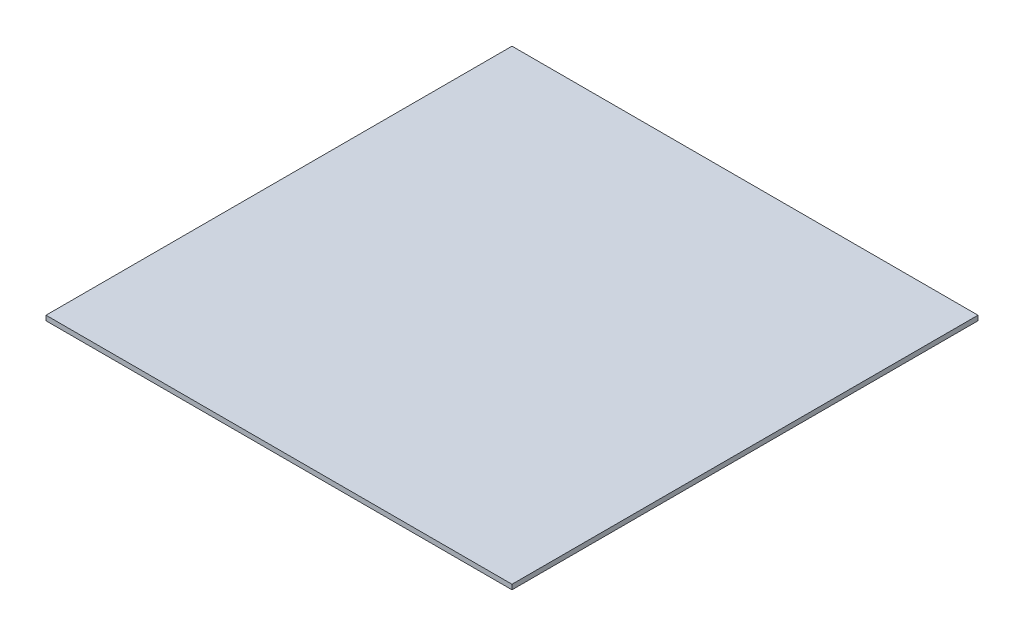
ISO-10303-21;
HEADER;
FILE_DESCRIPTION(('STEP AP214'),'2;1');
FILE_NAME('part.step','',(''),(''),'','','');
FILE_SCHEMA(('AUTOMOTIVE_DESIGN { 1 0 10303 214 1 1 1 1 }'));
ENDSEC;
DATA;
#1=APPLICATION_CONTEXT('core data for automotive mechanical design processes');
#2=APPLICATION_PROTOCOL_DEFINITION('international standard','automotive_design',2000,#1);
#3=PRODUCT_CONTEXT('',#1,'mechanical');
#4=PRODUCT('Part','Part','',(#3));
#5=PRODUCT_RELATED_PRODUCT_CATEGORY('part','',(#4));
#6=PRODUCT_DEFINITION_FORMATION('','',#4);
#7=PRODUCT_DEFINITION_CONTEXT('part definition',#1,'design');
#8=PRODUCT_DEFINITION('design','',#6,#7);
#9=PRODUCT_DEFINITION_SHAPE('','',#8);
#10=(LENGTH_UNIT() NAMED_UNIT(*) SI_UNIT(.MILLI.,.METRE.));
#11=(NAMED_UNIT(*) PLANE_ANGLE_UNIT() SI_UNIT($,.RADIAN.));
#12=(NAMED_UNIT(*) SI_UNIT($,.STERADIAN.) SOLID_ANGLE_UNIT());
#13=UNCERTAINTY_MEASURE_WITH_UNIT(LENGTH_MEASURE(1.E-05),#10,'distance_accuracy_value','');
#14=(GEOMETRIC_REPRESENTATION_CONTEXT(3) GLOBAL_UNCERTAINTY_ASSIGNED_CONTEXT((#13)) GLOBAL_UNIT_ASSIGNED_CONTEXT((#10,
#11,#12)) REPRESENTATION_CONTEXT('',''));
#15=CARTESIAN_POINT('',(0.,0.,0.));
#16=DIRECTION('',(0.,0.,1.));
#17=DIRECTION('',(1.,0.,0.));
#18=AXIS2_PLACEMENT_3D('',#15,#16,#17);
#19=CARTESIAN_POINT('',(0.,12.7,0.));
#20=DIRECTION('',(0.,0.,-1.));
#21=DIRECTION('',(-1.,0.,0.));
#22=AXIS2_PLACEMENT_3D('',#19,#20,#21);
#23=PLANE('',#22);
#24=DIRECTION('',(1.,0.,0.));
#25=VECTOR('',#24,1.);
#26=CARTESIAN_POINT('',(0.,0.,0.));
#27=LINE('',#26,#25);
#28=CARTESIAN_POINT('',(0.,0.,0.));
#29=VERTEX_POINT('',#28);
#30=CARTESIAN_POINT('',(1219.2,0.,0.));
#31=VERTEX_POINT('',#30);
#32=EDGE_CURVE('E100',#29,#31,#27,.T.);
#33=ORIENTED_EDGE('',*,*,#32,.F.);
#34=DIRECTION('',(0.,-1.,0.));
#35=VECTOR('',#34,1.);
#36=CARTESIAN_POINT('',(0.,12.7,0.));
#37=LINE('',#36,#35);
#38=CARTESIAN_POINT('',(0.,12.7,0.));
#39=VERTEX_POINT('',#38);
#40=EDGE_CURVE('E11',#39,#29,#37,.T.);
#41=ORIENTED_EDGE('',*,*,#40,.F.);
#42=DIRECTION('',(1.,0.,0.));
#43=VECTOR('',#42,1.);
#44=CARTESIAN_POINT('',(0.,12.7,0.));
#45=LINE('',#44,#43);
#46=CARTESIAN_POINT('',(1219.2,12.7,0.));
#47=VERTEX_POINT('',#46);
#48=EDGE_CURVE('E95',#39,#47,#45,.T.);
#49=ORIENTED_EDGE('',*,*,#48,.T.);
#50=DIRECTION('',(0.,-1.,0.));
#51=VECTOR('',#50,1.);
#52=CARTESIAN_POINT('',(1219.2,12.7,0.));
#53=LINE('',#52,#51);
#54=EDGE_CURVE('E38',#47,#31,#53,.T.);
#55=ORIENTED_EDGE('',*,*,#54,.T.);
#56=EDGE_LOOP('',(#33,#41,#49,#55));
#57=FACE_BOUND('',#56,.T.);
#58=ADVANCED_FACE('F35',(#57),#23,.T.);
#59=CARTESIAN_POINT('',(0.,12.7,0.));
#60=DIRECTION('',(1.,0.,0.));
#61=DIRECTION('',(0.,0.,-1.));
#62=AXIS2_PLACEMENT_3D('',#59,#60,#61);
#63=PLANE('',#62);
#64=DIRECTION('',(0.,0.,1.));
#65=VECTOR('',#64,1.);
#66=CARTESIAN_POINT('',(0.,0.,0.));
#67=LINE('',#66,#65);
#68=CARTESIAN_POINT('',(1.49308937752045E-13,0.,1219.2));
#69=VERTEX_POINT('',#68);
#70=EDGE_CURVE('E68',#29,#69,#67,.T.);
#71=ORIENTED_EDGE('',*,*,#70,.T.);
#72=DIRECTION('',(0.,-1.,0.));
#73=VECTOR('',#72,1.);
#74=CARTESIAN_POINT('',(1.49308937752045E-13,12.7,1219.2));
#75=LINE('',#74,#73);
#76=CARTESIAN_POINT('',(1.49308937752045E-13,12.7,1219.2));
#77=VERTEX_POINT('',#76);
#78=EDGE_CURVE('E44',#77,#69,#75,.T.);
#79=ORIENTED_EDGE('',*,*,#78,.F.);
#80=DIRECTION('',(0.,0.,1.));
#81=VECTOR('',#80,1.);
#82=CARTESIAN_POINT('',(0.,12.7,0.));
#83=LINE('',#82,#81);
#84=EDGE_CURVE('E85',#39,#77,#83,.T.);
#85=ORIENTED_EDGE('',*,*,#84,.F.);
#86=ORIENTED_EDGE('',*,*,#40,.T.);
#87=EDGE_LOOP('',(#71,#79,#85,#86));
#88=FACE_BOUND('',#87,.T.);
#89=ADVANCED_FACE('F110',(#88),#63,.F.);
#90=CARTESIAN_POINT('',(1.49308937752045E-13,12.7,1219.2));
#91=DIRECTION('',(0.,0.,-1.));
#92=DIRECTION('',(-1.,0.,0.));
#93=AXIS2_PLACEMENT_3D('',#90,#91,#92);
#94=PLANE('',#93);
#95=DIRECTION('',(1.,0.,0.));
#96=VECTOR('',#95,1.);
#97=CARTESIAN_POINT('',(1.49308937752045E-13,0.,1219.2));
#98=LINE('',#97,#96);
#99=CARTESIAN_POINT('',(1219.2,0.,1219.2));
#100=VERTEX_POINT('',#99);
#101=EDGE_CURVE('E92',#69,#100,#98,.T.);
#102=ORIENTED_EDGE('',*,*,#101,.T.);
#103=DIRECTION('',(0.,-1.,0.));
#104=VECTOR('',#103,1.);
#105=CARTESIAN_POINT('',(1219.2,12.7,1219.2));
#106=LINE('',#105,#104);
#107=CARTESIAN_POINT('',(1219.2,12.7,1219.2));
#108=VERTEX_POINT('',#107);
#109=EDGE_CURVE('E89',#108,#100,#106,.T.);
#110=ORIENTED_EDGE('',*,*,#109,.F.);
#111=DIRECTION('',(1.,0.,0.));
#112=VECTOR('',#111,1.);
#113=CARTESIAN_POINT('',(1.49308937752045E-13,12.7,1219.2));
#114=LINE('',#113,#112);
#115=EDGE_CURVE('E80',#77,#108,#114,.T.);
#116=ORIENTED_EDGE('',*,*,#115,.F.);
#117=ORIENTED_EDGE('',*,*,#78,.T.);
#118=EDGE_LOOP('',(#102,#110,#116,#117));
#119=FACE_BOUND('',#118,.T.);
#120=ADVANCED_FACE('F90',(#119),#94,.F.);
#121=CARTESIAN_POINT('',(1219.2,12.7,0.));
#122=DIRECTION('',(1.,0.,0.));
#123=DIRECTION('',(0.,0.,-1.));
#124=AXIS2_PLACEMENT_3D('',#121,#122,#123);
#125=PLANE('',#124);
#126=DIRECTION('',(0.,0.,1.));
#127=VECTOR('',#126,1.);
#128=CARTESIAN_POINT('',(1219.2,0.,0.));
#129=LINE('',#128,#127);
#130=EDGE_CURVE('E103',#31,#100,#129,.T.);
#131=ORIENTED_EDGE('',*,*,#130,.F.);
#132=ORIENTED_EDGE('',*,*,#54,.F.);
#133=DIRECTION('',(0.,0.,1.));
#134=VECTOR('',#133,1.);
#135=CARTESIAN_POINT('',(1219.2,12.7,0.));
#136=LINE('',#135,#134);
#137=EDGE_CURVE('E84',#47,#108,#136,.T.);
#138=ORIENTED_EDGE('',*,*,#137,.T.);
#139=ORIENTED_EDGE('',*,*,#109,.T.);
#140=EDGE_LOOP('',(#131,#132,#138,#139));
#141=FACE_BOUND('',#140,.T.);
#142=ADVANCED_FACE('F94',(#141),#125,.T.);
#143=CARTESIAN_POINT('',(0.,12.7,0.));
#144=DIRECTION('',(0.,-1.,0.));
#145=DIRECTION('',(0.,0.,-1.));
#146=AXIS2_PLACEMENT_3D('',#143,#144,#145);
#147=PLANE('',#146);
#148=ORIENTED_EDGE('',*,*,#48,.F.);
#149=ORIENTED_EDGE('',*,*,#84,.T.);
#150=ORIENTED_EDGE('',*,*,#115,.T.);
#151=ORIENTED_EDGE('',*,*,#137,.F.);
#152=EDGE_LOOP('',(#148,#149,#150,#151));
#153=FACE_BOUND('',#152,.T.);
#154=ADVANCED_FACE('F83',(#153),#147,.F.);
#155=CARTESIAN_POINT('',(0.,0.,0.));
#156=DIRECTION('',(0.,-1.,0.));
#157=DIRECTION('',(0.,0.,-1.));
#158=AXIS2_PLACEMENT_3D('',#155,#156,#157);
#159=PLANE('',#158);
#160=ORIENTED_EDGE('',*,*,#32,.T.);
#161=ORIENTED_EDGE('',*,*,#130,.T.);
#162=ORIENTED_EDGE('',*,*,#101,.F.);
#163=ORIENTED_EDGE('',*,*,#70,.F.);
#164=EDGE_LOOP('',(#160,#161,#162,#163));
#165=FACE_BOUND('',#164,.T.);
#166=ADVANCED_FACE('F108',(#165),#159,.T.);
#167=CLOSED_SHELL('',(#58,#89,#120,#142,#154,#166));
#168=MANIFOLD_SOLID_BREP('B2',#167);
#169=ADVANCED_BREP_SHAPE_REPRESENTATION('',(#18,#168),#14);
#170=SHAPE_DEFINITION_REPRESENTATION(#9,#169);
ENDSEC;
END-ISO-10303-21;
